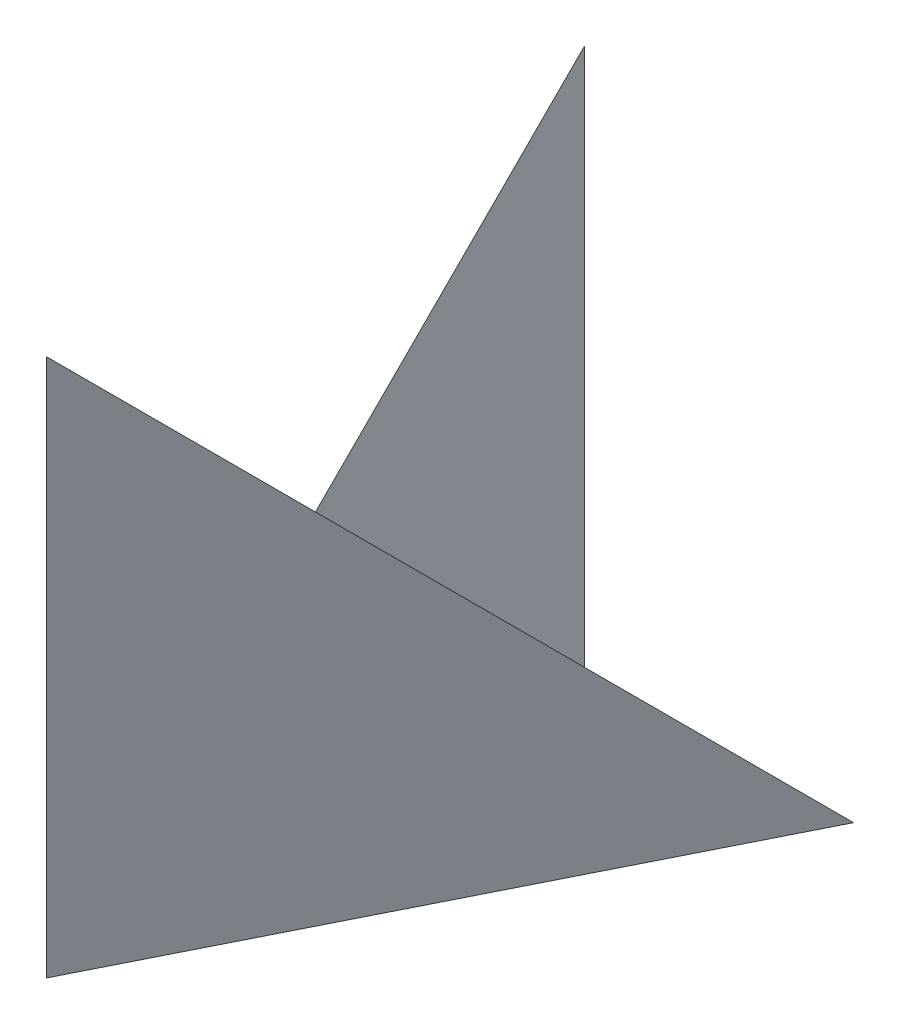
ISO-10303-21;
HEADER;
FILE_DESCRIPTION(('STEP AP214'),'2;1');
FILE_NAME('part.step','',(''),(''),'','','');
FILE_SCHEMA(('AUTOMOTIVE_DESIGN { 1 0 10303 214 1 1 1 1 }'));
ENDSEC;
DATA;
#1=APPLICATION_CONTEXT('core data for automotive mechanical design processes');
#2=APPLICATION_PROTOCOL_DEFINITION('international standard','automotive_design',2000,#1);
#3=PRODUCT_CONTEXT('',#1,'mechanical');
#4=PRODUCT('Part','Part','',(#3));
#5=PRODUCT_RELATED_PRODUCT_CATEGORY('part','',(#4));
#6=PRODUCT_DEFINITION_FORMATION('','',#4);
#7=PRODUCT_DEFINITION_CONTEXT('part definition',#1,'design');
#8=PRODUCT_DEFINITION('design','',#6,#7);
#9=PRODUCT_DEFINITION_SHAPE('','',#8);
#10=(LENGTH_UNIT() NAMED_UNIT(*) SI_UNIT(.MILLI.,.METRE.));
#11=(NAMED_UNIT(*) PLANE_ANGLE_UNIT() SI_UNIT($,.RADIAN.));
#12=(NAMED_UNIT(*) SI_UNIT($,.STERADIAN.) SOLID_ANGLE_UNIT());
#13=UNCERTAINTY_MEASURE_WITH_UNIT(LENGTH_MEASURE(1.E-05),#10,'distance_accuracy_value','');
#14=(GEOMETRIC_REPRESENTATION_CONTEXT(3) GLOBAL_UNCERTAINTY_ASSIGNED_CONTEXT((#13)) GLOBAL_UNIT_ASSIGNED_CONTEXT((#10,
#11,#12)) REPRESENTATION_CONTEXT('',''));
#15=CARTESIAN_POINT('',(0.,0.,0.));
#16=DIRECTION('',(0.,0.,1.));
#17=DIRECTION('',(1.,0.,0.));
#18=AXIS2_PLACEMENT_3D('',#15,#16,#17);
#19=CARTESIAN_POINT('',(-2.,4.,-2.));
#20=DIRECTION('',(0.,0.,1.));
#21=DIRECTION('',(1.,0.,0.));
#22=AXIS2_PLACEMENT_3D('',#19,#20,#21);
#23=PLANE('',#22);
#24=DIRECTION('',(0.,-1.,0.));
#25=VECTOR('',#24,1.);
#26=CARTESIAN_POINT('',(0.,4.,-2.));
#27=LINE('',#26,#25);
#28=CARTESIAN_POINT('',(0.,4.,-2.));
#29=VERTEX_POINT('',#28);
#30=CARTESIAN_POINT('',(0.,0.,-2.));
#31=VERTEX_POINT('',#30);
#32=EDGE_CURVE('E86',#29,#31,#27,.T.);
#33=ORIENTED_EDGE('',*,*,#32,.T.);
#34=DIRECTION('',(-1.,0.,0.));
#35=VECTOR('',#34,1.);
#36=CARTESIAN_POINT('',(-2.,0.,-2.));
#37=LINE('',#36,#35);
#38=CARTESIAN_POINT('',(-2.,0.,-2.));
#39=VERTEX_POINT('',#38);
#40=EDGE_CURVE('E60',#31,#39,#37,.T.);
#41=ORIENTED_EDGE('',*,*,#40,.T.);
#42=DIRECTION('',(-0.447213595499958,-0.894427190999916,0.));
#43=VECTOR('',#42,1.);
#44=CARTESIAN_POINT('',(0.,4.,-2.));
#45=LINE('',#44,#43);
#46=EDGE_CURVE('E14',#39,#29,#45,.F.);
#47=ORIENTED_EDGE('',*,*,#46,.T.);
#48=EDGE_LOOP('',(#33,#41,#47));
#49=FACE_BOUND('',#48,.T.);
#50=ADVANCED_FACE('F37',(#49),#23,.F.);
#51=CARTESIAN_POINT('',(0.,0.,0.));
#52=DIRECTION('',(0.,-1.,0.));
#53=DIRECTION('',(0.,0.,-1.));
#54=AXIS2_PLACEMENT_3D('',#51,#52,#53);
#55=PLANE('',#54);
#56=CARTESIAN_POINT('',(2.,0.,-2.));
#57=VERTEX_POINT('',#56);
#58=EDGE_CURVE('E45',#57,#31,#37,.T.);
#59=ORIENTED_EDGE('',*,*,#58,.F.);
#60=DIRECTION('',(-0.447213595499958,0.,0.894427190999916));
#61=VECTOR('',#60,1.);
#62=CARTESIAN_POINT('',(0.799999999999999,0.,0.4));
#63=LINE('',#62,#61);
#64=CARTESIAN_POINT('',(0.,0.,2.));
#65=VERTEX_POINT('',#64);
#66=EDGE_CURVE('E89',#57,#65,#63,.T.);
#67=ORIENTED_EDGE('',*,*,#66,.T.);
#68=DIRECTION('',(-0.447213595499958,0.,-0.894427190999916));
#69=VECTOR('',#68,1.);
#70=CARTESIAN_POINT('',(0.,0.,2.));
#71=LINE('',#70,#69);
#72=EDGE_CURVE('E94',#65,#39,#71,.T.);
#73=ORIENTED_EDGE('',*,*,#72,.T.);
#74=ORIENTED_EDGE('',*,*,#40,.F.);
#75=EDGE_LOOP('',(#59,#67,#73,#74));
#76=FACE_BOUND('',#75,.T.);
#77=ADVANCED_FACE('F92',(#76),#55,.T.);
#78=CARTESIAN_POINT('',(0.,4.,-2.));
#79=DIRECTION('',(-1.,0.,0.));
#80=DIRECTION('',(0.,0.,1.));
#81=AXIS2_PLACEMENT_3D('',#78,#79,#80);
#82=PLANE('',#81);
#83=DIRECTION('',(0.,0.707106781186548,0.707106781186548));
#84=VECTOR('',#83,1.);
#85=CARTESIAN_POINT('',(0.,0.,-2.));
#86=LINE('',#85,#84);
#87=CARTESIAN_POINT('',(0.,2.,0.));
#88=VERTEX_POINT('',#87);
#89=CARTESIAN_POINT('',(0.,4.,2.));
#90=VERTEX_POINT('',#89);
#91=EDGE_CURVE('E53',#88,#90,#86,.T.);
#92=ORIENTED_EDGE('',*,*,#91,.F.);
#93=DIRECTION('',(0.,-0.707106781186548,0.707106781186548));
#94=VECTOR('',#93,1.);
#95=CARTESIAN_POINT('',(0.,4.,-2.));
#96=LINE('',#95,#94);
#97=EDGE_CURVE('E101',#88,#65,#96,.T.);
#98=ORIENTED_EDGE('',*,*,#97,.T.);
#99=DIRECTION('',(0.,1.,0.));
#100=VECTOR('',#99,1.);
#101=CARTESIAN_POINT('',(0.,4.,2.));
#102=LINE('',#101,#100);
#103=EDGE_CURVE('E95',#65,#90,#102,.T.);
#104=ORIENTED_EDGE('',*,*,#103,.T.);
#105=EDGE_LOOP('',(#92,#98,#104));
#106=FACE_BOUND('',#105,.T.);
#107=ADVANCED_FACE('F122',(#106),#82,.T.);
#108=CARTESIAN_POINT('',(-0.666666666666667,0.333333333333333,0.333333333333333));
#109=DIRECTION('',(0.816496580927726,-0.408248290463863,-0.408248290463863));
#110=DIRECTION('',(-0.447213595499958,0.,-0.894427190999916));
#111=AXIS2_PLACEMENT_3D('',#108,#109,#110);
#112=PLANE('',#111);
#113=ORIENTED_EDGE('',*,*,#72,.F.);
#114=ORIENTED_EDGE('',*,*,#97,.F.);
#115=EDGE_CURVE('E88',#29,#88,#96,.T.);
#116=ORIENTED_EDGE('',*,*,#115,.F.);
#117=ORIENTED_EDGE('',*,*,#46,.F.);
#118=EDGE_LOOP('',(#113,#114,#116,#117));
#119=FACE_BOUND('',#118,.T.);
#120=ADVANCED_FACE('F127',(#119),#112,.F.);
#121=CARTESIAN_POINT('',(0.799999999999999,10.,0.4));
#122=DIRECTION('',(0.894427190999916,0.,0.447213595499958));
#123=DIRECTION('',(0.447213595499958,0.,-0.894427190999916));
#124=AXIS2_PLACEMENT_3D('',#121,#122,#123);
#125=PLANE('',#124);
#126=ORIENTED_EDGE('',*,*,#103,.F.);
#127=ORIENTED_EDGE('',*,*,#66,.F.);
#128=DIRECTION('',(-0.333333333333333,0.666666666666667,0.666666666666667));
#129=VECTOR('',#128,1.);
#130=CARTESIAN_POINT('',(0.444444444444444,3.11111111111111,1.11111111111111));
#131=LINE('',#130,#129);
#132=EDGE_CURVE('E79',#90,#57,#131,.F.);
#133=ORIENTED_EDGE('',*,*,#132,.F.);
#134=EDGE_LOOP('',(#126,#127,#133));
#135=FACE_BOUND('',#134,.T.);
#136=ADVANCED_FACE('F125',(#135),#125,.T.);
#137=CARTESIAN_POINT('',(0.,0.,0.));
#138=DIRECTION('',(1.,0.,0.));
#139=DIRECTION('',(0.,0.,-1.));
#140=AXIS2_PLACEMENT_3D('',#137,#138,#139);
#141=PLANE('',#140);
#142=ORIENTED_EDGE('',*,*,#115,.T.);
#143=EDGE_CURVE('E78',#31,#88,#86,.T.);
#144=ORIENTED_EDGE('',*,*,#143,.F.);
#145=ORIENTED_EDGE('',*,*,#32,.F.);
#146=EDGE_LOOP('',(#142,#144,#145));
#147=FACE_BOUND('',#146,.T.);
#148=ADVANCED_FACE('F85',(#147),#141,.T.);
#149=CARTESIAN_POINT('',(10.,0.,-2.));
#150=DIRECTION('',(0.,-0.707106781186548,0.707106781186548));
#151=DIRECTION('',(0.,-0.707106781186548,-0.707106781186548));
#152=AXIS2_PLACEMENT_3D('',#149,#150,#151);
#153=PLANE('',#152);
#154=ORIENTED_EDGE('',*,*,#132,.T.);
#155=ORIENTED_EDGE('',*,*,#58,.T.);
#156=ORIENTED_EDGE('',*,*,#143,.T.);
#157=ORIENTED_EDGE('',*,*,#91,.T.);
#158=EDGE_LOOP('',(#154,#155,#156,#157));
#159=FACE_BOUND('',#158,.T.);
#160=ADVANCED_FACE('F77',(#159),#153,.F.);
#161=CLOSED_SHELL('',(#50,#77,#107,#120,#136,#148,#160));
#162=MANIFOLD_SOLID_BREP('B2',#161);
#163=ADVANCED_BREP_SHAPE_REPRESENTATION('',(#18,#162),#14);
#164=SHAPE_DEFINITION_REPRESENTATION(#9,#163);
ENDSEC;
END-ISO-10303-21;
